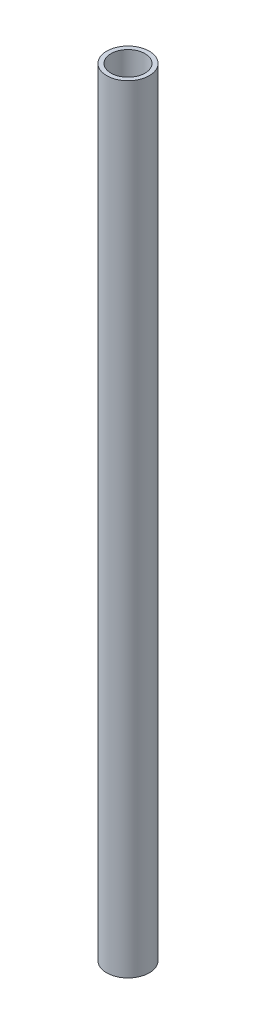
ISO-10303-21;
HEADER;
FILE_DESCRIPTION(('STEP AP214'),'2;1');
FILE_NAME('part.step','',(''),(''),'','','');
FILE_SCHEMA(('AUTOMOTIVE_DESIGN { 1 0 10303 214 1 1 1 1 }'));
ENDSEC;
DATA;
#1=APPLICATION_CONTEXT('core data for automotive mechanical design processes');
#2=APPLICATION_PROTOCOL_DEFINITION('international standard','automotive_design',2000,#1);
#3=PRODUCT_CONTEXT('',#1,'mechanical');
#4=PRODUCT('Part','Part','',(#3));
#5=PRODUCT_RELATED_PRODUCT_CATEGORY('part','',(#4));
#6=PRODUCT_DEFINITION_FORMATION('','',#4);
#7=PRODUCT_DEFINITION_CONTEXT('part definition',#1,'design');
#8=PRODUCT_DEFINITION('design','',#6,#7);
#9=PRODUCT_DEFINITION_SHAPE('','',#8);
#10=(LENGTH_UNIT() NAMED_UNIT(*) SI_UNIT(.MILLI.,.METRE.));
#11=(NAMED_UNIT(*) PLANE_ANGLE_UNIT() SI_UNIT($,.RADIAN.));
#12=(NAMED_UNIT(*) SI_UNIT($,.STERADIAN.) SOLID_ANGLE_UNIT());
#13=UNCERTAINTY_MEASURE_WITH_UNIT(LENGTH_MEASURE(1.E-05),#10,'distance_accuracy_value','');
#14=(GEOMETRIC_REPRESENTATION_CONTEXT(3) GLOBAL_UNCERTAINTY_ASSIGNED_CONTEXT((#13)) GLOBAL_UNIT_ASSIGNED_CONTEXT((#10,
#11,#12)) REPRESENTATION_CONTEXT('',''));
#15=CARTESIAN_POINT('',(0.,0.,0.));
#16=DIRECTION('',(0.,0.,1.));
#17=DIRECTION('',(1.,0.,0.));
#18=AXIS2_PLACEMENT_3D('',#15,#16,#17);
#19=CARTESIAN_POINT('',(0.,609.6,0.));
#20=DIRECTION('',(0.,1.,0.));
#21=DIRECTION('',(0.,0.,1.));
#22=AXIS2_PLACEMENT_3D('',#19,#20,#21);
#23=PLANE('',#22);
#24=CARTESIAN_POINT('',(0.,609.6,0.));
#25=DIRECTION('',(0.,1.,0.));
#26=DIRECTION('',(0.,0.,1.));
#27=AXIS2_PLACEMENT_3D('',#24,#25,#26);
#28=CIRCLE('',#27,16.7005);
#29=CARTESIAN_POINT('',(0.,609.6,16.7005));
#30=VERTEX_POINT('',#29);
#31=EDGE_CURVE('E10',#30,#30,#28,.T.);
#32=ORIENTED_EDGE('',*,*,#31,.T.);
#33=EDGE_LOOP('',(#32));
#34=FACE_BOUND('',#33,.T.);
#35=CARTESIAN_POINT('',(0.,609.6,0.));
#36=DIRECTION('',(0.,1.,0.));
#37=DIRECTION('',(0.,0.,1.));
#38=AXIS2_PLACEMENT_3D('',#35,#36,#37);
#39=CIRCLE('',#38,13.3223);
#40=CARTESIAN_POINT('',(0.,609.6,13.3223));
#41=VERTEX_POINT('',#40);
#42=EDGE_CURVE('E48',#41,#41,#39,.T.);
#43=ORIENTED_EDGE('',*,*,#42,.F.);
#44=EDGE_LOOP('',(#43));
#45=FACE_BOUND('',#44,.T.);
#46=ADVANCED_FACE('F37',(#34,#45),#23,.T.);
#47=CARTESIAN_POINT('',(0.,0.,0.));
#48=DIRECTION('',(0.,1.,0.));
#49=DIRECTION('',(0.,0.,1.));
#50=AXIS2_PLACEMENT_3D('',#47,#48,#49);
#51=PLANE('',#50);
#52=CARTESIAN_POINT('',(0.,0.,0.));
#53=DIRECTION('',(0.,1.,0.));
#54=DIRECTION('',(0.,0.,1.));
#55=AXIS2_PLACEMENT_3D('',#52,#53,#54);
#56=CIRCLE('',#55,16.7005);
#57=CARTESIAN_POINT('',(0.,0.,16.7005));
#58=VERTEX_POINT('',#57);
#59=EDGE_CURVE('E41',#58,#58,#56,.T.);
#60=ORIENTED_EDGE('',*,*,#59,.F.);
#61=EDGE_LOOP('',(#60));
#62=FACE_BOUND('',#61,.T.);
#63=CARTESIAN_POINT('',(0.,0.,0.));
#64=DIRECTION('',(0.,1.,0.));
#65=DIRECTION('',(0.,0.,1.));
#66=AXIS2_PLACEMENT_3D('',#63,#64,#65);
#67=CIRCLE('',#66,13.3223);
#68=CARTESIAN_POINT('',(0.,0.,13.3223));
#69=VERTEX_POINT('',#68);
#70=EDGE_CURVE('E50',#69,#69,#67,.T.);
#71=ORIENTED_EDGE('',*,*,#70,.T.);
#72=EDGE_LOOP('',(#71));
#73=FACE_BOUND('',#72,.T.);
#74=ADVANCED_FACE('F60',(#62,#73),#51,.F.);
#75=CARTESIAN_POINT('',(0.,609.6,0.));
#76=DIRECTION('',(0.,-1.,0.));
#77=DIRECTION('',(0.,0.,-1.));
#78=AXIS2_PLACEMENT_3D('',#75,#76,#77);
#79=CYLINDRICAL_SURFACE('',#78,16.7005);
#80=ORIENTED_EDGE('',*,*,#31,.F.);
#81=EDGE_LOOP('',(#80));
#82=FACE_BOUND('',#81,.T.);
#83=ORIENTED_EDGE('',*,*,#59,.T.);
#84=EDGE_LOOP('',(#83));
#85=FACE_BOUND('',#84,.T.);
#86=ADVANCED_FACE('F39',(#82,#85),#79,.T.);
#87=CARTESIAN_POINT('',(0.,609.6,0.));
#88=DIRECTION('',(0.,-1.,0.));
#89=DIRECTION('',(0.,0.,-1.));
#90=AXIS2_PLACEMENT_3D('',#87,#88,#89);
#91=CYLINDRICAL_SURFACE('',#90,13.3223);
#92=ORIENTED_EDGE('',*,*,#42,.T.);
#93=EDGE_LOOP('',(#92));
#94=FACE_BOUND('',#93,.T.);
#95=ORIENTED_EDGE('',*,*,#70,.F.);
#96=EDGE_LOOP('',(#95));
#97=FACE_BOUND('',#96,.T.);
#98=ADVANCED_FACE('F56',(#94,#97),#91,.F.);
#99=CLOSED_SHELL('',(#46,#74,#86,#98));
#100=MANIFOLD_SOLID_BREP('B2',#99);
#101=ADVANCED_BREP_SHAPE_REPRESENTATION('',(#18,#100),#14);
#102=SHAPE_DEFINITION_REPRESENTATION(#9,#101);
ENDSEC;
END-ISO-10303-21;
